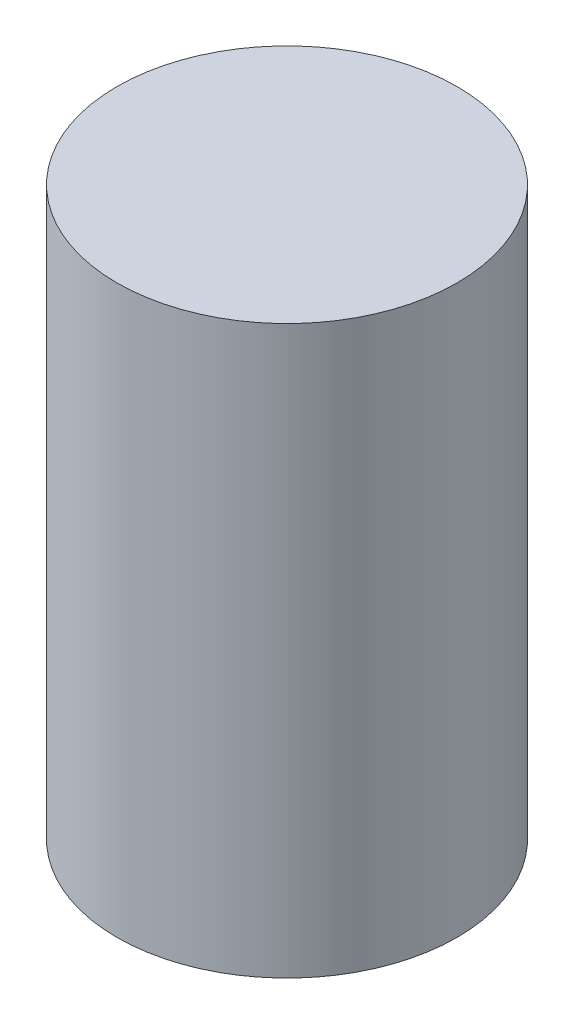
ISO-10303-21;
HEADER;
FILE_DESCRIPTION(('STEP AP214'),'2;1');
FILE_NAME('part.step','',(''),(''),'','','');
FILE_SCHEMA(('AUTOMOTIVE_DESIGN { 1 0 10303 214 1 1 1 1 }'));
ENDSEC;
DATA;
#1=APPLICATION_CONTEXT('core data for automotive mechanical design processes');
#2=APPLICATION_PROTOCOL_DEFINITION('international standard','automotive_design',2000,#1);
#3=PRODUCT_CONTEXT('',#1,'mechanical');
#4=PRODUCT('Part','Part','',(#3));
#5=PRODUCT_RELATED_PRODUCT_CATEGORY('part','',(#4));
#6=PRODUCT_DEFINITION_FORMATION('','',#4);
#7=PRODUCT_DEFINITION_CONTEXT('part definition',#1,'design');
#8=PRODUCT_DEFINITION('design','',#6,#7);
#9=PRODUCT_DEFINITION_SHAPE('','',#8);
#10=(LENGTH_UNIT() NAMED_UNIT(*) SI_UNIT(.MILLI.,.METRE.));
#11=(NAMED_UNIT(*) PLANE_ANGLE_UNIT() SI_UNIT($,.RADIAN.));
#12=(NAMED_UNIT(*) SI_UNIT($,.STERADIAN.) SOLID_ANGLE_UNIT());
#13=UNCERTAINTY_MEASURE_WITH_UNIT(LENGTH_MEASURE(1.E-05),#10,'distance_accuracy_value','');
#14=(GEOMETRIC_REPRESENTATION_CONTEXT(3) GLOBAL_UNCERTAINTY_ASSIGNED_CONTEXT((#13)) GLOBAL_UNIT_ASSIGNED_CONTEXT((#10,
#11,#12)) REPRESENTATION_CONTEXT('',''));
#15=CARTESIAN_POINT('',(0.,0.,0.));
#16=DIRECTION('',(0.,0.,1.));
#17=DIRECTION('',(1.,0.,0.));
#18=AXIS2_PLACEMENT_3D('',#15,#16,#17);
#19=CARTESIAN_POINT('',(0.,127.,0.));
#20=DIRECTION('',(0.,-1.,0.));
#21=DIRECTION('',(0.,0.,-1.));
#22=AXIS2_PLACEMENT_3D('',#19,#20,#21);
#23=CYLINDRICAL_SURFACE('',#22,38.1);
#24=CARTESIAN_POINT('',(0.,127.,0.));
#25=DIRECTION('',(0.,1.,0.));
#26=DIRECTION('',(0.,0.,1.));
#27=AXIS2_PLACEMENT_3D('',#24,#25,#26);
#28=CIRCLE('',#27,38.1);
#29=CARTESIAN_POINT('',(0.,127.,38.1));
#30=VERTEX_POINT('',#29);
#31=EDGE_CURVE('E10',#30,#30,#28,.T.);
#32=ORIENTED_EDGE('',*,*,#31,.F.);
#33=EDGE_LOOP('',(#32));
#34=FACE_BOUND('',#33,.T.);
#35=CARTESIAN_POINT('',(0.,0.,0.));
#36=DIRECTION('',(0.,1.,0.));
#37=DIRECTION('',(0.,0.,1.));
#38=AXIS2_PLACEMENT_3D('',#35,#36,#37);
#39=CIRCLE('',#38,38.1);
#40=CARTESIAN_POINT('',(0.,0.,38.1));
#41=VERTEX_POINT('',#40);
#42=EDGE_CURVE('E38',#41,#41,#39,.T.);
#43=ORIENTED_EDGE('',*,*,#42,.T.);
#44=EDGE_LOOP('',(#43));
#45=FACE_BOUND('',#44,.T.);
#46=ADVANCED_FACE('F35',(#34,#45),#23,.T.);
#47=CARTESIAN_POINT('',(0.,127.,0.));
#48=DIRECTION('',(0.,1.,0.));
#49=DIRECTION('',(0.,0.,1.));
#50=AXIS2_PLACEMENT_3D('',#47,#48,#49);
#51=PLANE('',#50);
#52=ORIENTED_EDGE('',*,*,#31,.T.);
#53=EDGE_LOOP('',(#52));
#54=FACE_BOUND('',#53,.T.);
#55=ADVANCED_FACE('F50',(#54),#51,.T.);
#56=CARTESIAN_POINT('',(0.,0.,0.));
#57=DIRECTION('',(0.,1.,0.));
#58=DIRECTION('',(0.,0.,1.));
#59=AXIS2_PLACEMENT_3D('',#56,#57,#58);
#60=PLANE('',#59);
#61=ORIENTED_EDGE('',*,*,#42,.F.);
#62=EDGE_LOOP('',(#61));
#63=FACE_BOUND('',#62,.T.);
#64=ADVANCED_FACE('F48',(#63),#60,.F.);
#65=CLOSED_SHELL('',(#46,#55,#64));
#66=MANIFOLD_SOLID_BREP('B2',#65);
#67=ADVANCED_BREP_SHAPE_REPRESENTATION('',(#18,#66),#14);
#68=SHAPE_DEFINITION_REPRESENTATION(#9,#67);
ENDSEC;
END-ISO-10303-21;
